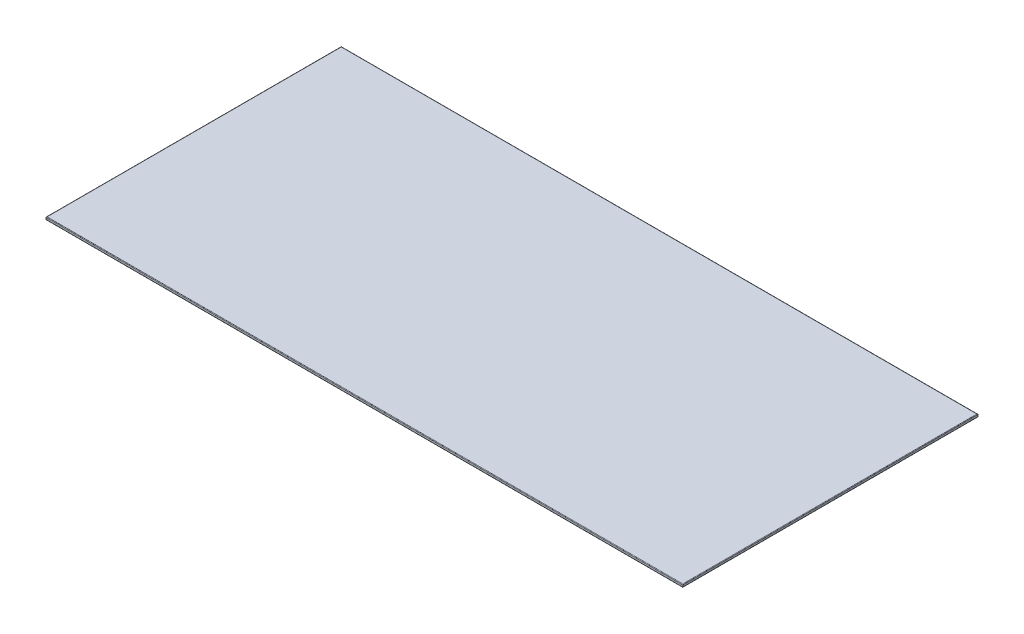
ISO-10303-21;
HEADER;
FILE_DESCRIPTION(('STEP AP214'),'2;1');
FILE_NAME('part.step','',(''),(''),'','','');
FILE_SCHEMA(('AUTOMOTIVE_DESIGN { 1 0 10303 214 1 1 1 1 }'));
ENDSEC;
DATA;
#1=APPLICATION_CONTEXT('core data for automotive mechanical design processes');
#2=APPLICATION_PROTOCOL_DEFINITION('international standard','automotive_design',2000,#1);
#3=PRODUCT_CONTEXT('',#1,'mechanical');
#4=PRODUCT('Part','Part','',(#3));
#5=PRODUCT_RELATED_PRODUCT_CATEGORY('part','',(#4));
#6=PRODUCT_DEFINITION_FORMATION('','',#4);
#7=PRODUCT_DEFINITION_CONTEXT('part definition',#1,'design');
#8=PRODUCT_DEFINITION('design','',#6,#7);
#9=PRODUCT_DEFINITION_SHAPE('','',#8);
#10=(LENGTH_UNIT() NAMED_UNIT(*) SI_UNIT(.MILLI.,.METRE.));
#11=(NAMED_UNIT(*) PLANE_ANGLE_UNIT() SI_UNIT($,.RADIAN.));
#12=(NAMED_UNIT(*) SI_UNIT($,.STERADIAN.) SOLID_ANGLE_UNIT());
#13=UNCERTAINTY_MEASURE_WITH_UNIT(LENGTH_MEASURE(1.E-05),#10,'distance_accuracy_value','');
#14=(GEOMETRIC_REPRESENTATION_CONTEXT(3) GLOBAL_UNCERTAINTY_ASSIGNED_CONTEXT((#13)) GLOBAL_UNIT_ASSIGNED_CONTEXT((#10,
#11,#12)) REPRESENTATION_CONTEXT('',''));
#15=CARTESIAN_POINT('',(0.,0.,0.));
#16=DIRECTION('',(0.,0.,1.));
#17=DIRECTION('',(1.,0.,0.));
#18=AXIS2_PLACEMENT_3D('',#15,#16,#17);
#19=CARTESIAN_POINT('',(578.,5.,268.));
#20=DIRECTION('',(-1.,0.,0.));
#21=DIRECTION('',(0.,0.,1.));
#22=AXIS2_PLACEMENT_3D('',#19,#20,#21);
#23=PLANE('',#22);
#24=DIRECTION('',(0.,-1.,0.));
#25=VECTOR('',#24,1.);
#26=CARTESIAN_POINT('',(578.,5.,268.));
#27=LINE('',#26,#25);
#28=CARTESIAN_POINT('',(578.,4.,268.));
#29=VERTEX_POINT('',#28);
#30=CARTESIAN_POINT('',(578.,1.,268.));
#31=VERTEX_POINT('',#30);
#32=EDGE_CURVE('E106',#29,#31,#27,.T.);
#33=ORIENTED_EDGE('',*,*,#32,.T.);
#34=DIRECTION('',(0.,0.,-1.));
#35=VECTOR('',#34,1.);
#36=CARTESIAN_POINT('',(578.,1.,-268.));
#37=LINE('',#36,#35);
#38=CARTESIAN_POINT('',(578.,1.,-268.));
#39=VERTEX_POINT('',#38);
#40=EDGE_CURVE('E155',#31,#39,#37,.T.);
#41=ORIENTED_EDGE('',*,*,#40,.T.);
#42=DIRECTION('',(0.,-1.,0.));
#43=VECTOR('',#42,1.);
#44=CARTESIAN_POINT('',(578.,5.,-268.));
#45=LINE('',#44,#43);
#46=CARTESIAN_POINT('',(578.,4.,-268.));
#47=VERTEX_POINT('',#46);
#48=EDGE_CURVE('E132',#47,#39,#45,.T.);
#49=ORIENTED_EDGE('',*,*,#48,.F.);
#50=DIRECTION('',(0.,0.,-1.));
#51=VECTOR('',#50,1.);
#52=CARTESIAN_POINT('',(578.,4.,268.));
#53=LINE('',#52,#51);
#54=EDGE_CURVE('E157',#47,#29,#53,.F.);
#55=ORIENTED_EDGE('',*,*,#54,.T.);
#56=EDGE_LOOP('',(#33,#41,#49,#55));
#57=FACE_BOUND('',#56,.T.);
#58=ADVANCED_FACE('F33',(#57),#23,.F.);
#59=CARTESIAN_POINT('',(-578.,5.,-268.));
#60=DIRECTION('',(0.,0.,1.));
#61=DIRECTION('',(1.,0.,0.));
#62=AXIS2_PLACEMENT_3D('',#59,#60,#61);
#63=PLANE('',#62);
#64=ORIENTED_EDGE('',*,*,#48,.T.);
#65=DIRECTION('',(-1.,0.,0.));
#66=VECTOR('',#65,1.);
#67=CARTESIAN_POINT('',(-578.,1.,-268.));
#68=LINE('',#67,#66);
#69=CARTESIAN_POINT('',(-578.,1.,-268.));
#70=VERTEX_POINT('',#69);
#71=EDGE_CURVE('E112',#39,#70,#68,.T.);
#72=ORIENTED_EDGE('',*,*,#71,.T.);
#73=DIRECTION('',(0.,-1.,0.));
#74=VECTOR('',#73,1.);
#75=CARTESIAN_POINT('',(-578.,5.,-268.));
#76=LINE('',#75,#74);
#77=CARTESIAN_POINT('',(-578.,4.,-268.));
#78=VERTEX_POINT('',#77);
#79=EDGE_CURVE('E123',#78,#70,#76,.T.);
#80=ORIENTED_EDGE('',*,*,#79,.F.);
#81=DIRECTION('',(-1.,0.,0.));
#82=VECTOR('',#81,1.);
#83=CARTESIAN_POINT('',(-578.,4.,-268.));
#84=LINE('',#83,#82);
#85=EDGE_CURVE('E161',#78,#47,#84,.F.);
#86=ORIENTED_EDGE('',*,*,#85,.T.);
#87=EDGE_LOOP('',(#64,#72,#80,#86));
#88=FACE_BOUND('',#87,.T.);
#89=ADVANCED_FACE('F200',(#88),#63,.F.);
#90=CARTESIAN_POINT('',(-578.,5.,268.));
#91=DIRECTION('',(1.,0.,0.));
#92=DIRECTION('',(0.,0.,-1.));
#93=AXIS2_PLACEMENT_3D('',#90,#91,#92);
#94=PLANE('',#93);
#95=ORIENTED_EDGE('',*,*,#79,.T.);
#96=DIRECTION('',(0.,0.,1.));
#97=VECTOR('',#96,1.);
#98=CARTESIAN_POINT('',(-578.,1.,268.));
#99=LINE('',#98,#97);
#100=CARTESIAN_POINT('',(-578.,1.,268.));
#101=VERTEX_POINT('',#100);
#102=EDGE_CURVE('E122',#70,#101,#99,.T.);
#103=ORIENTED_EDGE('',*,*,#102,.T.);
#104=DIRECTION('',(0.,-1.,0.));
#105=VECTOR('',#104,1.);
#106=CARTESIAN_POINT('',(-578.,5.,268.));
#107=LINE('',#106,#105);
#108=CARTESIAN_POINT('',(-578.,4.,268.));
#109=VERTEX_POINT('',#108);
#110=EDGE_CURVE('E104',#109,#101,#107,.T.);
#111=ORIENTED_EDGE('',*,*,#110,.F.);
#112=DIRECTION('',(0.,0.,1.));
#113=VECTOR('',#112,1.);
#114=CARTESIAN_POINT('',(-578.,4.,268.));
#115=LINE('',#114,#113);
#116=EDGE_CURVE('E119',#109,#78,#115,.F.);
#117=ORIENTED_EDGE('',*,*,#116,.T.);
#118=EDGE_LOOP('',(#95,#103,#111,#117));
#119=FACE_BOUND('',#118,.T.);
#120=ADVANCED_FACE('F118',(#119),#94,.F.);
#121=CARTESIAN_POINT('',(-578.,5.,268.));
#122=DIRECTION('',(0.,0.,-1.));
#123=DIRECTION('',(-1.,0.,0.));
#124=AXIS2_PLACEMENT_3D('',#121,#122,#123);
#125=PLANE('',#124);
#126=ORIENTED_EDGE('',*,*,#110,.T.);
#127=DIRECTION('',(1.,0.,0.));
#128=VECTOR('',#127,1.);
#129=CARTESIAN_POINT('',(578.,1.,268.));
#130=LINE('',#129,#128);
#131=EDGE_CURVE('E111',#101,#31,#130,.T.);
#132=ORIENTED_EDGE('',*,*,#131,.T.);
#133=ORIENTED_EDGE('',*,*,#32,.F.);
#134=DIRECTION('',(1.,0.,0.));
#135=VECTOR('',#134,1.);
#136=CARTESIAN_POINT('',(-578.,4.,268.));
#137=LINE('',#136,#135);
#138=EDGE_CURVE('E101',#29,#109,#137,.F.);
#139=ORIENTED_EDGE('',*,*,#138,.T.);
#140=EDGE_LOOP('',(#126,#132,#133,#139));
#141=FACE_BOUND('',#140,.T.);
#142=ADVANCED_FACE('F103',(#141),#125,.F.);
#143=CARTESIAN_POINT('',(0.,5.,0.));
#144=DIRECTION('',(0.,-1.,0.));
#145=DIRECTION('',(0.,0.,-1.));
#146=AXIS2_PLACEMENT_3D('',#143,#144,#145);
#147=PLANE('',#146);
#148=DIRECTION('',(1.,0.,0.));
#149=VECTOR('',#148,1.);
#150=CARTESIAN_POINT('',(0.,5.,267.));
#151=LINE('',#150,#149);
#152=CARTESIAN_POINT('',(-577.,5.,267.));
#153=VERTEX_POINT('',#152);
#154=CARTESIAN_POINT('',(577.,5.,267.));
#155=VERTEX_POINT('',#154);
#156=EDGE_CURVE('E135',#153,#155,#151,.T.);
#157=ORIENTED_EDGE('',*,*,#156,.T.);
#158=DIRECTION('',(0.,0.,-1.));
#159=VECTOR('',#158,1.);
#160=CARTESIAN_POINT('',(577.,5.,0.));
#161=LINE('',#160,#159);
#162=CARTESIAN_POINT('',(577.,5.,-267.));
#163=VERTEX_POINT('',#162);
#164=EDGE_CURVE('E11',#155,#163,#161,.T.);
#165=ORIENTED_EDGE('',*,*,#164,.T.);
#166=DIRECTION('',(-1.,0.,0.));
#167=VECTOR('',#166,1.);
#168=CARTESIAN_POINT('',(0.,5.,-267.));
#169=LINE('',#168,#167);
#170=CARTESIAN_POINT('',(-577.,5.,-267.));
#171=VERTEX_POINT('',#170);
#172=EDGE_CURVE('E42',#163,#171,#169,.T.);
#173=ORIENTED_EDGE('',*,*,#172,.T.);
#174=DIRECTION('',(0.,0.,1.));
#175=VECTOR('',#174,1.);
#176=CARTESIAN_POINT('',(-577.,5.,0.));
#177=LINE('',#176,#175);
#178=EDGE_CURVE('E152',#171,#153,#177,.T.);
#179=ORIENTED_EDGE('',*,*,#178,.T.);
#180=EDGE_LOOP('',(#157,#165,#173,#179));
#181=FACE_BOUND('',#180,.T.);
#182=ADVANCED_FACE('F203',(#181),#147,.F.);
#183=CARTESIAN_POINT('',(0.,0.,0.));
#184=DIRECTION('',(0.,-1.,0.));
#185=DIRECTION('',(0.,0.,-1.));
#186=AXIS2_PLACEMENT_3D('',#183,#184,#185);
#187=PLANE('',#186);
#188=DIRECTION('',(1.,0.,0.));
#189=VECTOR('',#188,1.);
#190=CARTESIAN_POINT('',(-578.,0.,267.));
#191=LINE('',#190,#189);
#192=CARTESIAN_POINT('',(577.,0.,267.));
#193=VERTEX_POINT('',#192);
#194=CARTESIAN_POINT('',(-577.,0.,267.));
#195=VERTEX_POINT('',#194);
#196=EDGE_CURVE('E168',#193,#195,#191,.F.);
#197=ORIENTED_EDGE('',*,*,#196,.T.);
#198=DIRECTION('',(0.,0.,1.));
#199=VECTOR('',#198,1.);
#200=CARTESIAN_POINT('',(-577.,0.,-268.));
#201=LINE('',#200,#199);
#202=CARTESIAN_POINT('',(-577.,0.,-267.));
#203=VERTEX_POINT('',#202);
#204=EDGE_CURVE('E163',#195,#203,#201,.F.);
#205=ORIENTED_EDGE('',*,*,#204,.T.);
#206=DIRECTION('',(-1.,0.,0.));
#207=VECTOR('',#206,1.);
#208=CARTESIAN_POINT('',(578.,0.,-267.));
#209=LINE('',#208,#207);
#210=CARTESIAN_POINT('',(577.,0.,-267.));
#211=VERTEX_POINT('',#210);
#212=EDGE_CURVE('E166',#203,#211,#209,.F.);
#213=ORIENTED_EDGE('',*,*,#212,.T.);
#214=DIRECTION('',(0.,0.,-1.));
#215=VECTOR('',#214,1.);
#216=CARTESIAN_POINT('',(577.,0.,268.));
#217=LINE('',#216,#215);
#218=EDGE_CURVE('E170',#211,#193,#217,.F.);
#219=ORIENTED_EDGE('',*,*,#218,.T.);
#220=EDGE_LOOP('',(#197,#205,#213,#219));
#221=FACE_BOUND('',#220,.T.);
#222=ADVANCED_FACE('F192',(#221),#187,.T.);
#223=CARTESIAN_POINT('',(577.,1.,268.));
#224=DIRECTION('',(0.,0.,1.));
#225=DIRECTION('',(1.,0.,0.));
#226=AXIS2_PLACEMENT_3D('',#223,#224,#225);
#227=CYLINDRICAL_SURFACE('',#226,1.);
#228=CARTESIAN_POINT('',(577.,1.,267.));
#229=DIRECTION('',(-0.707106781186547,0.,0.707106781186547));
#230=DIRECTION('',(0.707106781186547,0.,0.707106781186547));
#231=AXIS2_PLACEMENT_3D('',#228,#229,#230);
#232=ELLIPSE('',#231,1.41421356237309,1.);
#233=EDGE_CURVE('E147',#193,#31,#232,.T.);
#234=ORIENTED_EDGE('',*,*,#233,.F.);
#235=ORIENTED_EDGE('',*,*,#218,.F.);
#236=CARTESIAN_POINT('',(577.,1.,-267.));
#237=DIRECTION('',(0.707106781186547,0.,0.707106781186547));
#238=DIRECTION('',(-0.707106781186547,0.,0.707106781186547));
#239=AXIS2_PLACEMENT_3D('',#236,#237,#238);
#240=ELLIPSE('',#239,1.41421356237309,1.);
#241=EDGE_CURVE('E144',#39,#211,#240,.F.);
#242=ORIENTED_EDGE('',*,*,#241,.F.);
#243=ORIENTED_EDGE('',*,*,#40,.F.);
#244=EDGE_LOOP('',(#234,#235,#242,#243));
#245=FACE_BOUND('',#244,.T.);
#246=ADVANCED_FACE('F182',(#245),#227,.T.);
#247=CARTESIAN_POINT('',(-578.,1.,-267.));
#248=DIRECTION('',(1.,0.,0.));
#249=DIRECTION('',(0.,0.,-1.));
#250=AXIS2_PLACEMENT_3D('',#247,#248,#249);
#251=CYLINDRICAL_SURFACE('',#250,1.);
#252=ORIENTED_EDGE('',*,*,#241,.T.);
#253=ORIENTED_EDGE('',*,*,#212,.F.);
#254=CARTESIAN_POINT('',(-577.,1.,-267.));
#255=DIRECTION('',(0.707106781186547,0.,-0.707106781186547));
#256=DIRECTION('',(0.707106781186547,0.,0.707106781186547));
#257=AXIS2_PLACEMENT_3D('',#254,#255,#256);
#258=ELLIPSE('',#257,1.41421356237309,1.);
#259=EDGE_CURVE('E137',#70,#203,#258,.F.);
#260=ORIENTED_EDGE('',*,*,#259,.F.);
#261=ORIENTED_EDGE('',*,*,#71,.F.);
#262=EDGE_LOOP('',(#252,#253,#260,#261));
#263=FACE_BOUND('',#262,.T.);
#264=ADVANCED_FACE('F198',(#263),#251,.T.);
#265=CARTESIAN_POINT('',(-578.,1.,267.));
#266=DIRECTION('',(-1.,0.,0.));
#267=DIRECTION('',(0.,0.,1.));
#268=AXIS2_PLACEMENT_3D('',#265,#266,#267);
#269=CYLINDRICAL_SURFACE('',#268,1.);
#270=ORIENTED_EDGE('',*,*,#233,.T.);
#271=ORIENTED_EDGE('',*,*,#131,.F.);
#272=CARTESIAN_POINT('',(-577.,1.,267.));
#273=DIRECTION('',(-0.707106781186547,0.,-0.707106781186547));
#274=DIRECTION('',(-0.707106781186547,0.,0.707106781186547));
#275=AXIS2_PLACEMENT_3D('',#272,#273,#274);
#276=ELLIPSE('',#275,1.41421356237309,1.);
#277=EDGE_CURVE('E136',#195,#101,#276,.T.);
#278=ORIENTED_EDGE('',*,*,#277,.F.);
#279=ORIENTED_EDGE('',*,*,#196,.F.);
#280=EDGE_LOOP('',(#270,#271,#278,#279));
#281=FACE_BOUND('',#280,.T.);
#282=ADVANCED_FACE('F188',(#281),#269,.T.);
#283=CARTESIAN_POINT('',(-577.,1.,268.));
#284=DIRECTION('',(0.,0.,-1.));
#285=DIRECTION('',(-1.,0.,0.));
#286=AXIS2_PLACEMENT_3D('',#283,#284,#285);
#287=CYLINDRICAL_SURFACE('',#286,1.);
#288=ORIENTED_EDGE('',*,*,#259,.T.);
#289=ORIENTED_EDGE('',*,*,#204,.F.);
#290=ORIENTED_EDGE('',*,*,#277,.T.);
#291=ORIENTED_EDGE('',*,*,#102,.F.);
#292=EDGE_LOOP('',(#288,#289,#290,#291));
#293=FACE_BOUND('',#292,.T.);
#294=ADVANCED_FACE('F194',(#293),#287,.T.);
#295=CARTESIAN_POINT('',(-577.,4.,0.));
#296=DIRECTION('',(0.,0.,1.));
#297=DIRECTION('',(1.,0.,0.));
#298=AXIS2_PLACEMENT_3D('',#295,#296,#297);
#299=CYLINDRICAL_SURFACE('',#298,1.);
#300=CARTESIAN_POINT('',(-577.,4.,-267.));
#301=DIRECTION('',(-0.707106781186547,0.,0.707106781186547));
#302=DIRECTION('',(0.707106781186547,0.,0.707106781186547));
#303=AXIS2_PLACEMENT_3D('',#300,#301,#302);
#304=ELLIPSE('',#303,1.41421356237309,1.);
#305=EDGE_CURVE('E130',#78,#171,#304,.F.);
#306=ORIENTED_EDGE('',*,*,#305,.F.);
#307=ORIENTED_EDGE('',*,*,#116,.F.);
#308=CARTESIAN_POINT('',(-577.,4.,267.));
#309=DIRECTION('',(0.707106781186547,0.,0.707106781186547));
#310=DIRECTION('',(0.707106781186547,0.,-0.707106781186547));
#311=AXIS2_PLACEMENT_3D('',#308,#309,#310);
#312=ELLIPSE('',#311,1.41421356237309,1.);
#313=EDGE_CURVE('E37',#153,#109,#312,.T.);
#314=ORIENTED_EDGE('',*,*,#313,.F.);
#315=ORIENTED_EDGE('',*,*,#178,.F.);
#316=EDGE_LOOP('',(#306,#307,#314,#315));
#317=FACE_BOUND('',#316,.T.);
#318=ADVANCED_FACE('F35',(#317),#299,.T.);
#319=CARTESIAN_POINT('',(0.,4.,267.));
#320=DIRECTION('',(1.,0.,0.));
#321=DIRECTION('',(0.,0.,-1.));
#322=AXIS2_PLACEMENT_3D('',#319,#320,#321);
#323=CYLINDRICAL_SURFACE('',#322,1.);
#324=ORIENTED_EDGE('',*,*,#313,.T.);
#325=ORIENTED_EDGE('',*,*,#138,.F.);
#326=CARTESIAN_POINT('',(577.,4.,267.));
#327=DIRECTION('',(0.707106781186547,0.,-0.707106781186547));
#328=DIRECTION('',(0.707106781186547,0.,0.707106781186547));
#329=AXIS2_PLACEMENT_3D('',#326,#327,#328);
#330=ELLIPSE('',#329,1.41421356237309,1.);
#331=EDGE_CURVE('E139',#155,#29,#330,.T.);
#332=ORIENTED_EDGE('',*,*,#331,.F.);
#333=ORIENTED_EDGE('',*,*,#156,.F.);
#334=EDGE_LOOP('',(#324,#325,#332,#333));
#335=FACE_BOUND('',#334,.T.);
#336=ADVANCED_FACE('F134',(#335),#323,.T.);
#337=CARTESIAN_POINT('',(0.,4.,-267.));
#338=DIRECTION('',(-1.,0.,0.));
#339=DIRECTION('',(0.,0.,1.));
#340=AXIS2_PLACEMENT_3D('',#337,#338,#339);
#341=CYLINDRICAL_SURFACE('',#340,1.);
#342=ORIENTED_EDGE('',*,*,#305,.T.);
#343=ORIENTED_EDGE('',*,*,#172,.F.);
#344=CARTESIAN_POINT('',(577.,4.,-267.));
#345=DIRECTION('',(-0.707106781186547,0.,-0.707106781186547));
#346=DIRECTION('',(-0.707106781186547,0.,0.707106781186547));
#347=AXIS2_PLACEMENT_3D('',#344,#345,#346);
#348=ELLIPSE('',#347,1.41421356237309,1.);
#349=EDGE_CURVE('E50',#47,#163,#348,.F.);
#350=ORIENTED_EDGE('',*,*,#349,.F.);
#351=ORIENTED_EDGE('',*,*,#85,.F.);
#352=EDGE_LOOP('',(#342,#343,#350,#351));
#353=FACE_BOUND('',#352,.T.);
#354=ADVANCED_FACE('F202',(#353),#341,.T.);
#355=CARTESIAN_POINT('',(577.,4.,0.));
#356=DIRECTION('',(0.,0.,-1.));
#357=DIRECTION('',(-1.,0.,0.));
#358=AXIS2_PLACEMENT_3D('',#355,#356,#357);
#359=CYLINDRICAL_SURFACE('',#358,1.);
#360=ORIENTED_EDGE('',*,*,#331,.T.);
#361=ORIENTED_EDGE('',*,*,#54,.F.);
#362=ORIENTED_EDGE('',*,*,#349,.T.);
#363=ORIENTED_EDGE('',*,*,#164,.F.);
#364=EDGE_LOOP('',(#360,#361,#362,#363));
#365=FACE_BOUND('',#364,.T.);
#366=ADVANCED_FACE('F201',(#365),#359,.T.);
#367=CLOSED_SHELL('',(#58,#89,#120,#142,#182,#222,#246,#264,#282,#294,#318,#336,#354,#366));
#368=MANIFOLD_SOLID_BREP('B2',#367);
#369=ADVANCED_BREP_SHAPE_REPRESENTATION('',(#18,#368),#14);
#370=SHAPE_DEFINITION_REPRESENTATION(#9,#369);
ENDSEC;
END-ISO-10303-21;
